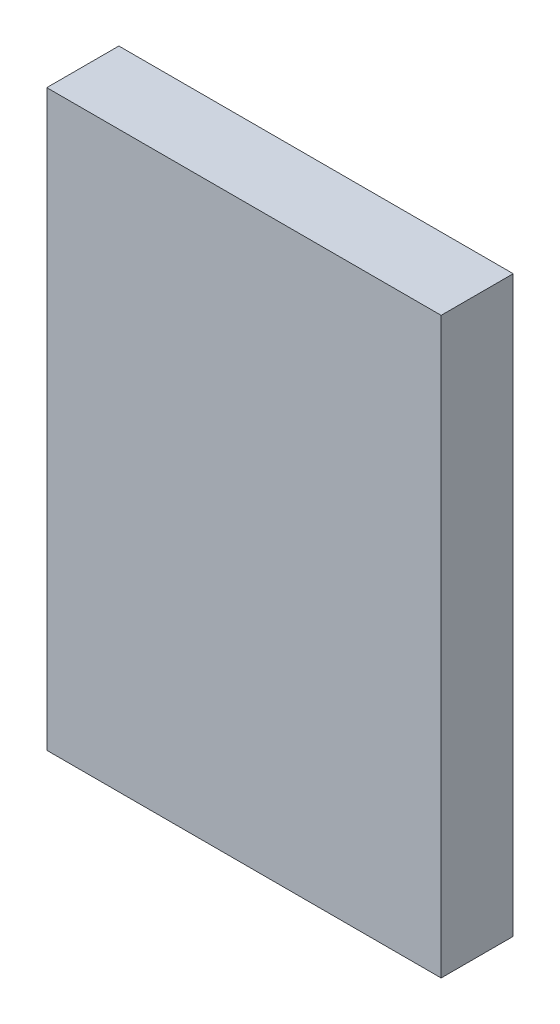
ISO-10303-21;
HEADER;
FILE_DESCRIPTION(('STEP AP214'),'2;1');
FILE_NAME('part.step','',(''),(''),'','','');
FILE_SCHEMA(('AUTOMOTIVE_DESIGN { 1 0 10303 214 1 1 1 1 }'));
ENDSEC;
DATA;
#1=APPLICATION_CONTEXT('core data for automotive mechanical design processes');
#2=APPLICATION_PROTOCOL_DEFINITION('international standard','automotive_design',2000,#1);
#3=PRODUCT_CONTEXT('',#1,'mechanical');
#4=PRODUCT('Part','Part','',(#3));
#5=PRODUCT_RELATED_PRODUCT_CATEGORY('part','',(#4));
#6=PRODUCT_DEFINITION_FORMATION('','',#4);
#7=PRODUCT_DEFINITION_CONTEXT('part definition',#1,'design');
#8=PRODUCT_DEFINITION('design','',#6,#7);
#9=PRODUCT_DEFINITION_SHAPE('','',#8);
#10=(LENGTH_UNIT() NAMED_UNIT(*) SI_UNIT(.MILLI.,.METRE.));
#11=(NAMED_UNIT(*) PLANE_ANGLE_UNIT() SI_UNIT($,.RADIAN.));
#12=(NAMED_UNIT(*) SI_UNIT($,.STERADIAN.) SOLID_ANGLE_UNIT());
#13=UNCERTAINTY_MEASURE_WITH_UNIT(LENGTH_MEASURE(1.E-05),#10,'distance_accuracy_value','');
#14=(GEOMETRIC_REPRESENTATION_CONTEXT(3) GLOBAL_UNCERTAINTY_ASSIGNED_CONTEXT((#13)) GLOBAL_UNIT_ASSIGNED_CONTEXT((#10,
#11,#12)) REPRESENTATION_CONTEXT('',''));
#15=CARTESIAN_POINT('',(0.,0.,0.));
#16=DIRECTION('',(0.,0.,1.));
#17=DIRECTION('',(1.,0.,0.));
#18=AXIS2_PLACEMENT_3D('',#15,#16,#17);
#19=CARTESIAN_POINT('',(-0.597,1.143,0.));
#20=DIRECTION('',(0.,-1.,0.));
#21=DIRECTION('',(0.,0.,-1.));
#22=AXIS2_PLACEMENT_3D('',#19,#20,#21);
#23=PLANE('',#22);
#24=DIRECTION('',(-1.,0.,0.));
#25=VECTOR('',#24,1.);
#26=CARTESIAN_POINT('',(-0.318,1.143,0.));
#27=LINE('',#26,#25);
#28=CARTESIAN_POINT('',(-0.318,1.143,0.));
#29=VERTEX_POINT('',#28);
#30=CARTESIAN_POINT('',(-0.597,1.143,0.));
#31=VERTEX_POINT('',#30);
#32=EDGE_CURVE('E11',#29,#31,#27,.T.);
#33=ORIENTED_EDGE('',*,*,#32,.F.);
#34=DIRECTION('',(0.,0.,-1.));
#35=VECTOR('',#34,1.);
#36=CARTESIAN_POINT('',(-0.318,1.143,0.051));
#37=LINE('',#36,#35);
#38=CARTESIAN_POINT('',(-0.318,1.143,0.051));
#39=VERTEX_POINT('',#38);
#40=EDGE_CURVE('E24',#39,#29,#37,.T.);
#41=ORIENTED_EDGE('',*,*,#40,.F.);
#42=DIRECTION('',(1.,0.,0.));
#43=VECTOR('',#42,1.);
#44=CARTESIAN_POINT('',(-0.597,1.143,0.051));
#45=LINE('',#44,#43);
#46=CARTESIAN_POINT('',(-0.597,1.143,0.051));
#47=VERTEX_POINT('',#46);
#48=EDGE_CURVE('E88',#47,#39,#45,.T.);
#49=ORIENTED_EDGE('',*,*,#48,.F.);
#50=DIRECTION('',(0.,0.,1.));
#51=VECTOR('',#50,1.);
#52=CARTESIAN_POINT('',(-0.597,1.143,0.));
#53=LINE('',#52,#51);
#54=EDGE_CURVE('E77',#31,#47,#53,.T.);
#55=ORIENTED_EDGE('',*,*,#54,.F.);
#56=EDGE_LOOP('',(#33,#41,#49,#55));
#57=FACE_BOUND('',#56,.T.);
#58=ADVANCED_FACE('F17',(#57),#23,.T.);
#59=CARTESIAN_POINT('',(-0.318,1.143,0.));
#60=DIRECTION('',(1.,0.,0.));
#61=DIRECTION('',(0.,1.,0.));
#62=AXIS2_PLACEMENT_3D('',#59,#60,#61);
#63=PLANE('',#62);
#64=DIRECTION('',(0.,-1.,0.));
#65=VECTOR('',#64,1.);
#66=CARTESIAN_POINT('',(-0.318,1.549,0.));
#67=LINE('',#66,#65);
#68=CARTESIAN_POINT('',(-0.318,1.549,0.));
#69=VERTEX_POINT('',#68);
#70=EDGE_CURVE('E85',#69,#29,#67,.T.);
#71=ORIENTED_EDGE('',*,*,#70,.F.);
#72=DIRECTION('',(0.,0.,-1.));
#73=VECTOR('',#72,1.);
#74=CARTESIAN_POINT('',(-0.318,1.549,0.051));
#75=LINE('',#74,#73);
#76=CARTESIAN_POINT('',(-0.318,1.549,0.051));
#77=VERTEX_POINT('',#76);
#78=EDGE_CURVE('E83',#77,#69,#75,.T.);
#79=ORIENTED_EDGE('',*,*,#78,.F.);
#80=DIRECTION('',(0.,1.,0.));
#81=VECTOR('',#80,1.);
#82=CARTESIAN_POINT('',(-0.318,1.143,0.051));
#83=LINE('',#82,#81);
#84=EDGE_CURVE('E72',#39,#77,#83,.T.);
#85=ORIENTED_EDGE('',*,*,#84,.F.);
#86=ORIENTED_EDGE('',*,*,#40,.T.);
#87=EDGE_LOOP('',(#71,#79,#85,#86));
#88=FACE_BOUND('',#87,.T.);
#89=ADVANCED_FACE('F90',(#88),#63,.T.);
#90=CARTESIAN_POINT('',(-0.318,1.549,0.));
#91=DIRECTION('',(0.,1.,0.));
#92=DIRECTION('',(1.,0.,0.));
#93=AXIS2_PLACEMENT_3D('',#90,#91,#92);
#94=PLANE('',#93);
#95=DIRECTION('',(1.,0.,0.));
#96=VECTOR('',#95,1.);
#97=CARTESIAN_POINT('',(-0.597,1.549,0.));
#98=LINE('',#97,#96);
#99=CARTESIAN_POINT('',(-0.597,1.549,0.));
#100=VERTEX_POINT('',#99);
#101=EDGE_CURVE('E60',#100,#69,#98,.T.);
#102=ORIENTED_EDGE('',*,*,#101,.F.);
#103=DIRECTION('',(0.,0.,-1.));
#104=VECTOR('',#103,1.);
#105=CARTESIAN_POINT('',(-0.597,1.549,0.051));
#106=LINE('',#105,#104);
#107=CARTESIAN_POINT('',(-0.597,1.549,0.051));
#108=VERTEX_POINT('',#107);
#109=EDGE_CURVE('E54',#108,#100,#106,.T.);
#110=ORIENTED_EDGE('',*,*,#109,.F.);
#111=DIRECTION('',(-1.,0.,0.));
#112=VECTOR('',#111,1.);
#113=CARTESIAN_POINT('',(-0.318,1.549,0.051));
#114=LINE('',#113,#112);
#115=EDGE_CURVE('E58',#77,#108,#114,.T.);
#116=ORIENTED_EDGE('',*,*,#115,.F.);
#117=ORIENTED_EDGE('',*,*,#78,.T.);
#118=EDGE_LOOP('',(#102,#110,#116,#117));
#119=FACE_BOUND('',#118,.T.);
#120=ADVANCED_FACE('F56',(#119),#94,.T.);
#121=CARTESIAN_POINT('',(-0.597,1.549,0.));
#122=DIRECTION('',(-1.,0.,0.));
#123=DIRECTION('',(0.,0.,1.));
#124=AXIS2_PLACEMENT_3D('',#121,#122,#123);
#125=PLANE('',#124);
#126=DIRECTION('',(0.,1.,0.));
#127=VECTOR('',#126,1.);
#128=CARTESIAN_POINT('',(-0.597,1.143,0.));
#129=LINE('',#128,#127);
#130=EDGE_CURVE('E73',#31,#100,#129,.T.);
#131=ORIENTED_EDGE('',*,*,#130,.F.);
#132=ORIENTED_EDGE('',*,*,#54,.T.);
#133=DIRECTION('',(0.,-1.,0.));
#134=VECTOR('',#133,1.);
#135=CARTESIAN_POINT('',(-0.597,1.549,0.051));
#136=LINE('',#135,#134);
#137=EDGE_CURVE('E70',#108,#47,#136,.T.);
#138=ORIENTED_EDGE('',*,*,#137,.F.);
#139=ORIENTED_EDGE('',*,*,#109,.T.);
#140=EDGE_LOOP('',(#131,#132,#138,#139));
#141=FACE_BOUND('',#140,.T.);
#142=ADVANCED_FACE('F76',(#141),#125,.T.);
#143=CARTESIAN_POINT('',(-0.597,1.549,0.));
#144=DIRECTION('',(0.,0.,-1.));
#145=DIRECTION('',(0.,-1.,0.));
#146=AXIS2_PLACEMENT_3D('',#143,#144,#145);
#147=PLANE('',#146);
#148=ORIENTED_EDGE('',*,*,#101,.T.);
#149=ORIENTED_EDGE('',*,*,#70,.T.);
#150=ORIENTED_EDGE('',*,*,#32,.T.);
#151=ORIENTED_EDGE('',*,*,#130,.T.);
#152=EDGE_LOOP('',(#148,#149,#150,#151));
#153=FACE_BOUND('',#152,.T.);
#154=ADVANCED_FACE('F91',(#153),#147,.T.);
#155=CARTESIAN_POINT('',(-0.597,1.143,0.051));
#156=DIRECTION('',(0.,0.,1.));
#157=DIRECTION('',(1.,0.,0.));
#158=AXIS2_PLACEMENT_3D('',#155,#156,#157);
#159=PLANE('',#158);
#160=ORIENTED_EDGE('',*,*,#48,.T.);
#161=ORIENTED_EDGE('',*,*,#84,.T.);
#162=ORIENTED_EDGE('',*,*,#115,.T.);
#163=ORIENTED_EDGE('',*,*,#137,.T.);
#164=EDGE_LOOP('',(#160,#161,#162,#163));
#165=FACE_BOUND('',#164,.T.);
#166=ADVANCED_FACE('F69',(#165),#159,.T.);
#167=CLOSED_SHELL('',(#58,#89,#120,#142,#154,#166));
#168=MANIFOLD_SOLID_BREP('B1',#167);
#169=ADVANCED_BREP_SHAPE_REPRESENTATION('',(#18,#168),#14);
#170=SHAPE_DEFINITION_REPRESENTATION(#9,#169);
ENDSEC;
END-ISO-10303-21;
